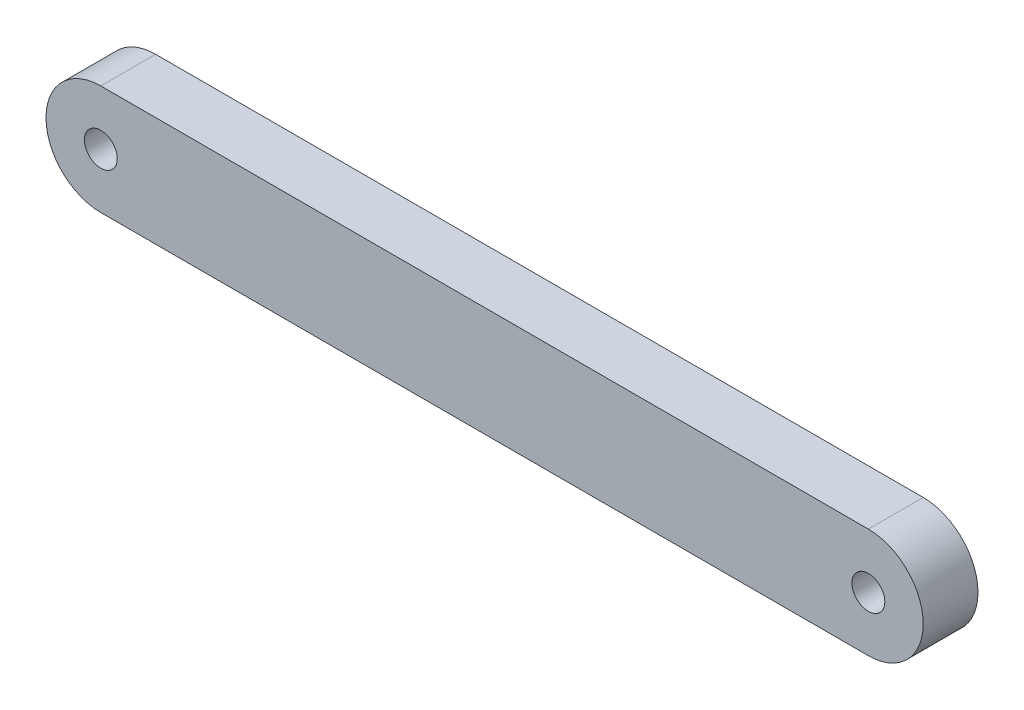
ISO-10303-21;
HEADER;
FILE_DESCRIPTION(('STEP AP214'),'2;1');
FILE_NAME('part.step','',(''),(''),'','','');
FILE_SCHEMA(('AUTOMOTIVE_DESIGN { 1 0 10303 214 1 1 1 1 }'));
ENDSEC;
DATA;
#1=APPLICATION_CONTEXT('core data for automotive mechanical design processes');
#2=APPLICATION_PROTOCOL_DEFINITION('international standard','automotive_design',2000,#1);
#3=PRODUCT_CONTEXT('',#1,'mechanical');
#4=PRODUCT('Part','Part','',(#3));
#5=PRODUCT_RELATED_PRODUCT_CATEGORY('part','',(#4));
#6=PRODUCT_DEFINITION_FORMATION('','',#4);
#7=PRODUCT_DEFINITION_CONTEXT('part definition',#1,'design');
#8=PRODUCT_DEFINITION('design','',#6,#7);
#9=PRODUCT_DEFINITION_SHAPE('','',#8);
#10=(LENGTH_UNIT() NAMED_UNIT(*) SI_UNIT(.MILLI.,.METRE.));
#11=(NAMED_UNIT(*) PLANE_ANGLE_UNIT() SI_UNIT($,.RADIAN.));
#12=(NAMED_UNIT(*) SI_UNIT($,.STERADIAN.) SOLID_ANGLE_UNIT());
#13=UNCERTAINTY_MEASURE_WITH_UNIT(LENGTH_MEASURE(1.E-05),#10,'distance_accuracy_value','');
#14=(GEOMETRIC_REPRESENTATION_CONTEXT(3) GLOBAL_UNCERTAINTY_ASSIGNED_CONTEXT((#13)) GLOBAL_UNIT_ASSIGNED_CONTEXT((#10,
#11,#12)) REPRESENTATION_CONTEXT('',''));
#15=CARTESIAN_POINT('',(0.,0.,0.));
#16=DIRECTION('',(0.,0.,1.));
#17=DIRECTION('',(1.,0.,0.));
#18=AXIS2_PLACEMENT_3D('',#15,#16,#17);
#19=CARTESIAN_POINT('',(-350.,0.,25.));
#20=DIRECTION('',(0.,0.,-1.));
#21=DIRECTION('',(-1.,0.,0.));
#22=AXIS2_PLACEMENT_3D('',#19,#20,#21);
#23=CYLINDRICAL_SURFACE('',#22,50.);
#24=CARTESIAN_POINT('',(-350.,0.,-25.));
#25=DIRECTION('',(0.,0.,1.));
#26=DIRECTION('',(1.,0.,0.));
#27=AXIS2_PLACEMENT_3D('',#24,#25,#26);
#28=CIRCLE('',#27,50.);
#29=CARTESIAN_POINT('',(-350.,50.,-25.));
#30=VERTEX_POINT('',#29);
#31=CARTESIAN_POINT('',(-350.,-50.,-25.));
#32=VERTEX_POINT('',#31);
#33=EDGE_CURVE('E100',#30,#32,#28,.T.);
#34=ORIENTED_EDGE('',*,*,#33,.T.);
#35=DIRECTION('',(0.,0.,-1.));
#36=VECTOR('',#35,1.);
#37=CARTESIAN_POINT('',(-350.,-50.,25.));
#38=LINE('',#37,#36);
#39=CARTESIAN_POINT('',(-350.,-50.,25.));
#40=VERTEX_POINT('',#39);
#41=EDGE_CURVE('E11',#40,#32,#38,.T.);
#42=ORIENTED_EDGE('',*,*,#41,.F.);
#43=CARTESIAN_POINT('',(-350.,0.,25.));
#44=DIRECTION('',(0.,0.,1.));
#45=DIRECTION('',(1.,0.,0.));
#46=AXIS2_PLACEMENT_3D('',#43,#44,#45);
#47=CIRCLE('',#46,50.);
#48=CARTESIAN_POINT('',(-350.,50.,25.));
#49=VERTEX_POINT('',#48);
#50=EDGE_CURVE('E88',#49,#40,#47,.T.);
#51=ORIENTED_EDGE('',*,*,#50,.F.);
#52=DIRECTION('',(0.,0.,-1.));
#53=VECTOR('',#52,1.);
#54=CARTESIAN_POINT('',(-350.,50.,25.));
#55=LINE('',#54,#53);
#56=EDGE_CURVE('E96',#49,#30,#55,.T.);
#57=ORIENTED_EDGE('',*,*,#56,.T.);
#58=EDGE_LOOP('',(#34,#42,#51,#57));
#59=FACE_BOUND('',#58,.T.);
#60=ADVANCED_FACE('F37',(#59),#23,.T.);
#61=CARTESIAN_POINT('',(-350.,-50.,25.));
#62=DIRECTION('',(0.,1.,0.));
#63=DIRECTION('',(0.,0.,1.));
#64=AXIS2_PLACEMENT_3D('',#61,#62,#63);
#65=PLANE('',#64);
#66=DIRECTION('',(1.,0.,0.));
#67=VECTOR('',#66,1.);
#68=CARTESIAN_POINT('',(-350.,-50.,-25.));
#69=LINE('',#68,#67);
#70=CARTESIAN_POINT('',(350.,-50.0000000000001,-25.));
#71=VERTEX_POINT('',#70);
#72=EDGE_CURVE('E92',#32,#71,#69,.T.);
#73=ORIENTED_EDGE('',*,*,#72,.T.);
#74=DIRECTION('',(0.,0.,-1.));
#75=VECTOR('',#74,1.);
#76=CARTESIAN_POINT('',(350.,-50.0000000000001,25.));
#77=LINE('',#76,#75);
#78=CARTESIAN_POINT('',(350.,-50.0000000000001,25.));
#79=VERTEX_POINT('',#78);
#80=EDGE_CURVE('E45',#79,#71,#77,.T.);
#81=ORIENTED_EDGE('',*,*,#80,.F.);
#82=DIRECTION('',(1.,0.,0.));
#83=VECTOR('',#82,1.);
#84=CARTESIAN_POINT('',(-350.,-50.,25.));
#85=LINE('',#84,#83);
#86=EDGE_CURVE('E83',#40,#79,#85,.T.);
#87=ORIENTED_EDGE('',*,*,#86,.F.);
#88=ORIENTED_EDGE('',*,*,#41,.T.);
#89=EDGE_LOOP('',(#73,#81,#87,#88));
#90=FACE_BOUND('',#89,.T.);
#91=ADVANCED_FACE('F91',(#90),#65,.F.);
#92=CARTESIAN_POINT('',(350.,0.,25.));
#93=DIRECTION('',(0.,0.,-1.));
#94=DIRECTION('',(-1.,0.,0.));
#95=AXIS2_PLACEMENT_3D('',#92,#93,#94);
#96=CYLINDRICAL_SURFACE('',#95,50.0000000000001);
#97=CARTESIAN_POINT('',(350.,0.,-25.));
#98=DIRECTION('',(0.,0.,1.));
#99=DIRECTION('',(1.,0.,0.));
#100=AXIS2_PLACEMENT_3D('',#97,#98,#99);
#101=CIRCLE('',#100,50.0000000000001);
#102=CARTESIAN_POINT('',(350.,50.0000000000002,-25.));
#103=VERTEX_POINT('',#102);
#104=EDGE_CURVE('E70',#71,#103,#101,.T.);
#105=ORIENTED_EDGE('',*,*,#104,.T.);
#106=DIRECTION('',(0.,0.,-1.));
#107=VECTOR('',#106,1.);
#108=CARTESIAN_POINT('',(350.,50.0000000000002,25.));
#109=LINE('',#108,#107);
#110=CARTESIAN_POINT('',(350.,50.0000000000002,25.));
#111=VERTEX_POINT('',#110);
#112=EDGE_CURVE('E93',#111,#103,#109,.T.);
#113=ORIENTED_EDGE('',*,*,#112,.F.);
#114=CARTESIAN_POINT('',(350.,0.,25.));
#115=DIRECTION('',(0.,0.,1.));
#116=DIRECTION('',(1.,0.,0.));
#117=AXIS2_PLACEMENT_3D('',#114,#115,#116);
#118=CIRCLE('',#117,50.0000000000001);
#119=EDGE_CURVE('E86',#79,#111,#118,.T.);
#120=ORIENTED_EDGE('',*,*,#119,.F.);
#121=ORIENTED_EDGE('',*,*,#80,.T.);
#122=EDGE_LOOP('',(#105,#113,#120,#121));
#123=FACE_BOUND('',#122,.T.);
#124=ADVANCED_FACE('F94',(#123),#96,.T.);
#125=CARTESIAN_POINT('',(-350.,50.,25.));
#126=DIRECTION('',(0.,-1.,0.));
#127=DIRECTION('',(1.,0.,0.));
#128=AXIS2_PLACEMENT_3D('',#125,#126,#127);
#129=PLANE('',#128);
#130=DIRECTION('',(-1.,0.,0.));
#131=VECTOR('',#130,1.);
#132=CARTESIAN_POINT('',(-350.,50.,-25.));
#133=LINE('',#132,#131);
#134=EDGE_CURVE('E76',#103,#30,#133,.T.);
#135=ORIENTED_EDGE('',*,*,#134,.T.);
#136=ORIENTED_EDGE('',*,*,#56,.F.);
#137=DIRECTION('',(-1.,0.,0.));
#138=VECTOR('',#137,1.);
#139=CARTESIAN_POINT('',(-350.,50.,25.));
#140=LINE('',#139,#138);
#141=EDGE_CURVE('E53',#111,#49,#140,.T.);
#142=ORIENTED_EDGE('',*,*,#141,.F.);
#143=ORIENTED_EDGE('',*,*,#112,.T.);
#144=EDGE_LOOP('',(#135,#136,#142,#143));
#145=FACE_BOUND('',#144,.T.);
#146=ADVANCED_FACE('F108',(#145),#129,.F.);
#147=CARTESIAN_POINT('',(-350.,0.,25.));
#148=DIRECTION('',(0.,0.,1.));
#149=DIRECTION('',(1.,0.,0.));
#150=AXIS2_PLACEMENT_3D('',#147,#148,#149);
#151=PLANE('',#150);
#152=CARTESIAN_POINT('',(-350.,0.,25.));
#153=DIRECTION('',(0.,0.,1.));
#154=DIRECTION('',(1.,0.,0.));
#155=AXIS2_PLACEMENT_3D('',#152,#153,#154);
#156=CIRCLE('',#155,15.);
#157=CARTESIAN_POINT('',(-335.,0.,25.));
#158=VERTEX_POINT('',#157);
#159=EDGE_CURVE('E120',#158,#158,#156,.T.);
#160=ORIENTED_EDGE('',*,*,#159,.F.);
#161=EDGE_LOOP('',(#160));
#162=FACE_BOUND('',#161,.T.);
#163=CARTESIAN_POINT('',(350.,0.,25.));
#164=DIRECTION('',(0.,0.,1.));
#165=DIRECTION('',(1.,0.,0.));
#166=AXIS2_PLACEMENT_3D('',#163,#164,#165);
#167=CIRCLE('',#166,15.);
#168=CARTESIAN_POINT('',(365.,0.,25.));
#169=VERTEX_POINT('',#168);
#170=EDGE_CURVE('E117',#169,#169,#167,.T.);
#171=ORIENTED_EDGE('',*,*,#170,.F.);
#172=EDGE_LOOP('',(#171));
#173=FACE_BOUND('',#172,.T.);
#174=ORIENTED_EDGE('',*,*,#50,.T.);
#175=ORIENTED_EDGE('',*,*,#86,.T.);
#176=ORIENTED_EDGE('',*,*,#119,.T.);
#177=ORIENTED_EDGE('',*,*,#141,.T.);
#178=EDGE_LOOP('',(#174,#175,#176,#177));
#179=FACE_BOUND('',#178,.T.);
#180=ADVANCED_FACE('F84',(#162,#173,#179),#151,.T.);
#181=CARTESIAN_POINT('',(-350.,0.,-25.));
#182=DIRECTION('',(0.,0.,1.));
#183=DIRECTION('',(1.,0.,0.));
#184=AXIS2_PLACEMENT_3D('',#181,#182,#183);
#185=PLANE('',#184);
#186=CARTESIAN_POINT('',(-350.,0.,-25.));
#187=DIRECTION('',(0.,0.,1.));
#188=DIRECTION('',(1.,0.,0.));
#189=AXIS2_PLACEMENT_3D('',#186,#187,#188);
#190=CIRCLE('',#189,15.);
#191=CARTESIAN_POINT('',(-335.,0.,-25.));
#192=VERTEX_POINT('',#191);
#193=EDGE_CURVE('E103',#192,#192,#190,.T.);
#194=ORIENTED_EDGE('',*,*,#193,.T.);
#195=EDGE_LOOP('',(#194));
#196=FACE_BOUND('',#195,.T.);
#197=CARTESIAN_POINT('',(350.,0.,-25.));
#198=DIRECTION('',(0.,0.,1.));
#199=DIRECTION('',(1.,0.,0.));
#200=AXIS2_PLACEMENT_3D('',#197,#198,#199);
#201=CIRCLE('',#200,15.);
#202=CARTESIAN_POINT('',(365.,0.,-25.));
#203=VERTEX_POINT('',#202);
#204=EDGE_CURVE('E114',#203,#203,#201,.T.);
#205=ORIENTED_EDGE('',*,*,#204,.T.);
#206=EDGE_LOOP('',(#205));
#207=FACE_BOUND('',#206,.T.);
#208=ORIENTED_EDGE('',*,*,#33,.F.);
#209=ORIENTED_EDGE('',*,*,#134,.F.);
#210=ORIENTED_EDGE('',*,*,#104,.F.);
#211=ORIENTED_EDGE('',*,*,#72,.F.);
#212=EDGE_LOOP('',(#208,#209,#210,#211));
#213=FACE_BOUND('',#212,.T.);
#214=ADVANCED_FACE('F111',(#196,#207,#213),#185,.F.);
#215=CARTESIAN_POINT('',(350.,0.,-25.));
#216=DIRECTION('',(0.,0.,1.));
#217=DIRECTION('',(1.,0.,0.));
#218=AXIS2_PLACEMENT_3D('',#215,#216,#217);
#219=CYLINDRICAL_SURFACE('',#218,15.);
#220=ORIENTED_EDGE('',*,*,#204,.F.);
#221=EDGE_LOOP('',(#220));
#222=FACE_BOUND('',#221,.T.);
#223=ORIENTED_EDGE('',*,*,#170,.T.);
#224=EDGE_LOOP('',(#223));
#225=FACE_BOUND('',#224,.T.);
#226=ADVANCED_FACE('F131',(#222,#225),#219,.F.);
#227=CARTESIAN_POINT('',(-350.,0.,-25.));
#228=DIRECTION('',(0.,0.,1.));
#229=DIRECTION('',(1.,0.,0.));
#230=AXIS2_PLACEMENT_3D('',#227,#228,#229);
#231=CYLINDRICAL_SURFACE('',#230,15.);
#232=ORIENTED_EDGE('',*,*,#193,.F.);
#233=EDGE_LOOP('',(#232));
#234=FACE_BOUND('',#233,.T.);
#235=ORIENTED_EDGE('',*,*,#159,.T.);
#236=EDGE_LOOP('',(#235));
#237=FACE_BOUND('',#236,.T.);
#238=ADVANCED_FACE('F128',(#234,#237),#231,.F.);
#239=CLOSED_SHELL('',(#60,#91,#124,#146,#180,#214,#226,#238));
#240=MANIFOLD_SOLID_BREP('B2',#239);
#241=ADVANCED_BREP_SHAPE_REPRESENTATION('',(#18,#240),#14);
#242=SHAPE_DEFINITION_REPRESENTATION(#9,#241);
ENDSEC;
END-ISO-10303-21;
